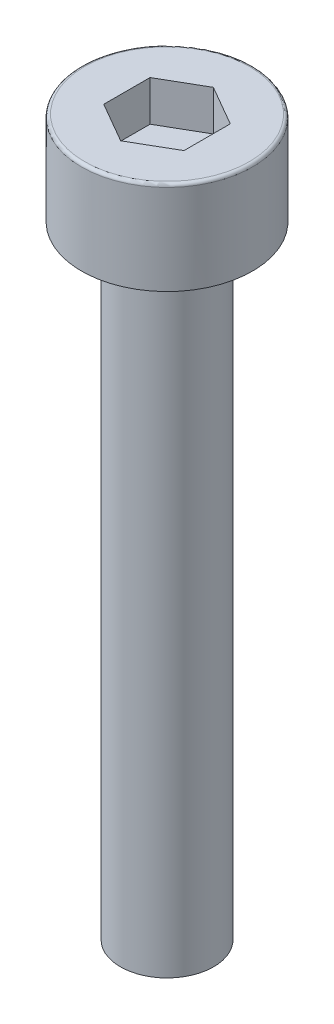
ISO-10303-21;
HEADER;
FILE_DESCRIPTION(('STEP AP214'),'2;1');
FILE_NAME('part.step','',(''),(''),'','','');
FILE_SCHEMA(('AUTOMOTIVE_DESIGN { 1 0 10303 214 1 1 1 1 }'));
ENDSEC;
DATA;
#1=APPLICATION_CONTEXT('core data for automotive mechanical design processes');
#2=APPLICATION_PROTOCOL_DEFINITION('international standard','automotive_design',2000,#1);
#3=PRODUCT_CONTEXT('',#1,'mechanical');
#4=PRODUCT('Part','Part','',(#3));
#5=PRODUCT_RELATED_PRODUCT_CATEGORY('part','',(#4));
#6=PRODUCT_DEFINITION_FORMATION('','',#4);
#7=PRODUCT_DEFINITION_CONTEXT('part definition',#1,'design');
#8=PRODUCT_DEFINITION('design','',#6,#7);
#9=PRODUCT_DEFINITION_SHAPE('','',#8);
#10=(LENGTH_UNIT() NAMED_UNIT(*) SI_UNIT(.MILLI.,.METRE.));
#11=(NAMED_UNIT(*) PLANE_ANGLE_UNIT() SI_UNIT($,.RADIAN.));
#12=(NAMED_UNIT(*) SI_UNIT($,.STERADIAN.) SOLID_ANGLE_UNIT());
#13=UNCERTAINTY_MEASURE_WITH_UNIT(LENGTH_MEASURE(1.E-05),#10,'distance_accuracy_value','');
#14=(GEOMETRIC_REPRESENTATION_CONTEXT(3) GLOBAL_UNCERTAINTY_ASSIGNED_CONTEXT((#13)) GLOBAL_UNIT_ASSIGNED_CONTEXT((#10,
#11,#12)) REPRESENTATION_CONTEXT('',''));
#15=CARTESIAN_POINT('',(0.,0.,0.));
#16=DIRECTION('',(0.,0.,1.));
#17=DIRECTION('',(1.,0.,0.));
#18=AXIS2_PLACEMENT_3D('',#15,#16,#17);
#19=CARTESIAN_POINT('',(1.5,0.,0.));
#20=DIRECTION('',(0.,-1.,0.));
#21=DIRECTION('',(0.,0.,-1.));
#22=AXIS2_PLACEMENT_3D('',#19,#20,#21);
#23=PLANE('',#22);
#24=CARTESIAN_POINT('',(0.,0.,0.));
#25=DIRECTION('',(0.,-1.,0.));
#26=DIRECTION('',(0.,0.,-1.));
#27=AXIS2_PLACEMENT_3D('',#24,#25,#26);
#28=CIRCLE('',#27,1.5);
#29=CARTESIAN_POINT('',(0.,0.,-1.5));
#30=VERTEX_POINT('',#29);
#31=EDGE_CURVE('E135',#30,#30,#28,.T.);
#32=ORIENTED_EDGE('',*,*,#31,.T.);
#33=EDGE_LOOP('',(#32));
#34=FACE_BOUND('',#33,.T.);
#35=ADVANCED_FACE('F33',(#34),#23,.T.);
#36=CARTESIAN_POINT('',(0.,23.,0.));
#37=DIRECTION('',(0.,1.,0.));
#38=DIRECTION('',(0.,0.,1.));
#39=AXIS2_PLACEMENT_3D('',#36,#37,#38);
#40=PLANE('',#39);
#41=CARTESIAN_POINT('',(0.,23.,0.));
#42=DIRECTION('',(0.,1.,0.));
#43=DIRECTION('',(0.,0.,1.));
#44=AXIS2_PLACEMENT_3D('',#41,#42,#43);
#45=CIRCLE('',#44,2.65);
#46=CARTESIAN_POINT('',(0.,23.,2.65));
#47=VERTEX_POINT('',#46);
#48=EDGE_CURVE('E11',#47,#47,#45,.T.);
#49=ORIENTED_EDGE('',*,*,#48,.T.);
#50=EDGE_LOOP('',(#49));
#51=FACE_BOUND('',#50,.T.);
#52=DIRECTION('',(-0.866025403784439,0.,-0.5));
#53=VECTOR('',#52,1.);
#54=CARTESIAN_POINT('',(1.29,23.,-0.744781847254618));
#55=LINE('',#54,#53);
#56=CARTESIAN_POINT('',(1.29,23.,-0.744781847254618));
#57=VERTEX_POINT('',#56);
#58=CARTESIAN_POINT('',(0.,23.,-1.48956369450923));
#59=VERTEX_POINT('',#58);
#60=EDGE_CURVE('E48',#57,#59,#55,.T.);
#61=ORIENTED_EDGE('',*,*,#60,.F.);
#62=DIRECTION('',(0.,0.,-1.));
#63=VECTOR('',#62,1.);
#64=CARTESIAN_POINT('',(1.29,23.,0.744781847254617));
#65=LINE('',#64,#63);
#66=CARTESIAN_POINT('',(1.29,23.,0.744781847254617));
#67=VERTEX_POINT('',#66);
#68=EDGE_CURVE('E131',#67,#57,#65,.T.);
#69=ORIENTED_EDGE('',*,*,#68,.F.);
#70=DIRECTION('',(0.866025403784439,0.,-0.5));
#71=VECTOR('',#70,1.);
#72=CARTESIAN_POINT('',(0.,23.,1.48956369450923));
#73=LINE('',#72,#71);
#74=CARTESIAN_POINT('',(0.,23.,1.48956369450923));
#75=VERTEX_POINT('',#74);
#76=EDGE_CURVE('E129',#75,#67,#73,.T.);
#77=ORIENTED_EDGE('',*,*,#76,.F.);
#78=DIRECTION('',(0.866025403784439,0.,0.5));
#79=VECTOR('',#78,1.);
#80=CARTESIAN_POINT('',(-1.29,23.,0.744781847254618));
#81=LINE('',#80,#79);
#82=CARTESIAN_POINT('',(-1.29,23.,0.744781847254618));
#83=VERTEX_POINT('',#82);
#84=EDGE_CURVE('E96',#83,#75,#81,.T.);
#85=ORIENTED_EDGE('',*,*,#84,.F.);
#86=DIRECTION('',(0.,0.,1.));
#87=VECTOR('',#86,1.);
#88=CARTESIAN_POINT('',(-1.29,23.,-0.744781847254617));
#89=LINE('',#88,#87);
#90=CARTESIAN_POINT('',(-1.29,23.,-0.744781847254617));
#91=VERTEX_POINT('',#90);
#92=EDGE_CURVE('E125',#91,#83,#89,.T.);
#93=ORIENTED_EDGE('',*,*,#92,.F.);
#94=DIRECTION('',(-0.866025403784439,0.,0.5));
#95=VECTOR('',#94,1.);
#96=CARTESIAN_POINT('',(0.,23.,-1.48956369450923));
#97=LINE('',#96,#95);
#98=EDGE_CURVE('E122',#59,#91,#97,.T.);
#99=ORIENTED_EDGE('',*,*,#98,.F.);
#100=EDGE_LOOP('',(#61,#69,#77,#85,#93,#99));
#101=FACE_BOUND('',#100,.T.);
#102=ADVANCED_FACE('F163',(#51,#101),#40,.T.);
#103=CARTESIAN_POINT('',(0.,0.,0.));
#104=DIRECTION('',(0.,-1.,0.));
#105=DIRECTION('',(0.,0.,-1.));
#106=AXIS2_PLACEMENT_3D('',#103,#104,#105);
#107=CYLINDRICAL_SURFACE('',#106,2.75);
#108=CARTESIAN_POINT('',(0.,22.9,0.));
#109=DIRECTION('',(0.,1.,0.));
#110=DIRECTION('',(0.,0.,1.));
#111=AXIS2_PLACEMENT_3D('',#108,#109,#110);
#112=CIRCLE('',#111,2.75);
#113=CARTESIAN_POINT('',(0.,22.9,2.75));
#114=VERTEX_POINT('',#113);
#115=EDGE_CURVE('E41',#114,#114,#112,.F.);
#116=ORIENTED_EDGE('',*,*,#115,.T.);
#117=EDGE_LOOP('',(#116));
#118=FACE_BOUND('',#117,.T.);
#119=CARTESIAN_POINT('',(0.,20.,0.));
#120=DIRECTION('',(0.,-1.,0.));
#121=DIRECTION('',(0.,0.,-1.));
#122=AXIS2_PLACEMENT_3D('',#119,#120,#121);
#123=CIRCLE('',#122,2.75);
#124=CARTESIAN_POINT('',(0.,20.,-2.75));
#125=VERTEX_POINT('',#124);
#126=EDGE_CURVE('E146',#125,#125,#123,.T.);
#127=ORIENTED_EDGE('',*,*,#126,.F.);
#128=EDGE_LOOP('',(#127));
#129=FACE_BOUND('',#128,.T.);
#130=ADVANCED_FACE('F151',(#118,#129),#107,.T.);
#131=CARTESIAN_POINT('',(2.75,20.,0.));
#132=DIRECTION('',(0.,-1.,0.));
#133=DIRECTION('',(0.,0.,-1.));
#134=AXIS2_PLACEMENT_3D('',#131,#132,#133);
#135=PLANE('',#134);
#136=ORIENTED_EDGE('',*,*,#126,.T.);
#137=EDGE_LOOP('',(#136));
#138=FACE_BOUND('',#137,.T.);
#139=CARTESIAN_POINT('',(0.,20.,0.));
#140=DIRECTION('',(0.,-1.,0.));
#141=DIRECTION('',(0.,0.,-1.));
#142=AXIS2_PLACEMENT_3D('',#139,#140,#141);
#143=CIRCLE('',#142,1.5);
#144=CARTESIAN_POINT('',(0.,20.,-1.5));
#145=VERTEX_POINT('',#144);
#146=EDGE_CURVE('E143',#145,#145,#143,.T.);
#147=ORIENTED_EDGE('',*,*,#146,.F.);
#148=EDGE_LOOP('',(#147));
#149=FACE_BOUND('',#148,.T.);
#150=ADVANCED_FACE('F173',(#138,#149),#135,.T.);
#151=CARTESIAN_POINT('',(0.,0.,0.));
#152=DIRECTION('',(0.,-1.,0.));
#153=DIRECTION('',(0.,0.,-1.));
#154=AXIS2_PLACEMENT_3D('',#151,#152,#153);
#155=CYLINDRICAL_SURFACE('',#154,1.5);
#156=ORIENTED_EDGE('',*,*,#146,.T.);
#157=EDGE_LOOP('',(#156));
#158=FACE_BOUND('',#157,.T.);
#159=ORIENTED_EDGE('',*,*,#31,.F.);
#160=EDGE_LOOP('',(#159));
#161=FACE_BOUND('',#160,.T.);
#162=ADVANCED_FACE('F176',(#158,#161),#155,.T.);
#163=CARTESIAN_POINT('',(1.29,21.7,-0.744781847254618));
#164=DIRECTION('',(0.5,0.,-0.866025403784439));
#165=DIRECTION('',(-0.866025403784439,0.,-0.5));
#166=AXIS2_PLACEMENT_3D('',#163,#164,#165);
#167=PLANE('',#166);
#168=ORIENTED_EDGE('',*,*,#60,.T.);
#169=DIRECTION('',(0.,1.,0.));
#170=VECTOR('',#169,1.);
#171=CARTESIAN_POINT('',(0.,21.7,-1.48956369450923));
#172=LINE('',#171,#170);
#173=CARTESIAN_POINT('',(0.,21.7,-1.48956369450923));
#174=VERTEX_POINT('',#173);
#175=EDGE_CURVE('E78',#174,#59,#172,.T.);
#176=ORIENTED_EDGE('',*,*,#175,.F.);
#177=DIRECTION('',(-0.866025403784439,0.,-0.5));
#178=VECTOR('',#177,1.);
#179=CARTESIAN_POINT('',(1.29,21.7,-0.744781847254618));
#180=LINE('',#179,#178);
#181=CARTESIAN_POINT('',(1.29,21.7,-0.744781847254618));
#182=VERTEX_POINT('',#181);
#183=EDGE_CURVE('E133',#182,#174,#180,.T.);
#184=ORIENTED_EDGE('',*,*,#183,.F.);
#185=DIRECTION('',(0.,1.,0.));
#186=VECTOR('',#185,1.);
#187=CARTESIAN_POINT('',(1.29,21.7,-0.744781847254618));
#188=LINE('',#187,#186);
#189=EDGE_CURVE('E56',#182,#57,#188,.T.);
#190=ORIENTED_EDGE('',*,*,#189,.T.);
#191=EDGE_LOOP('',(#168,#176,#184,#190));
#192=FACE_BOUND('',#191,.T.);
#193=ADVANCED_FACE('F180',(#192),#167,.F.);
#194=CARTESIAN_POINT('',(1.29,21.7,0.744781847254617));
#195=DIRECTION('',(1.,0.,0.));
#196=DIRECTION('',(0.,0.,-1.));
#197=AXIS2_PLACEMENT_3D('',#194,#195,#196);
#198=PLANE('',#197);
#199=ORIENTED_EDGE('',*,*,#68,.T.);
#200=ORIENTED_EDGE('',*,*,#189,.F.);
#201=DIRECTION('',(0.,0.,-1.));
#202=VECTOR('',#201,1.);
#203=CARTESIAN_POINT('',(1.29,21.7,0.744781847254617));
#204=LINE('',#203,#202);
#205=CARTESIAN_POINT('',(1.29,21.7,0.744781847254617));
#206=VERTEX_POINT('',#205);
#207=EDGE_CURVE('E108',#206,#182,#204,.T.);
#208=ORIENTED_EDGE('',*,*,#207,.F.);
#209=DIRECTION('',(0.,1.,0.));
#210=VECTOR('',#209,1.);
#211=CARTESIAN_POINT('',(1.29,21.7,0.744781847254617));
#212=LINE('',#211,#210);
#213=EDGE_CURVE('E100',#206,#67,#212,.T.);
#214=ORIENTED_EDGE('',*,*,#213,.T.);
#215=EDGE_LOOP('',(#199,#200,#208,#214));
#216=FACE_BOUND('',#215,.T.);
#217=ADVANCED_FACE('F184',(#216),#198,.F.);
#218=CARTESIAN_POINT('',(0.,21.7,1.48956369450923));
#219=DIRECTION('',(0.5,0.,0.866025403784439));
#220=DIRECTION('',(0.866025403784439,0.,-0.5));
#221=AXIS2_PLACEMENT_3D('',#218,#219,#220);
#222=PLANE('',#221);
#223=ORIENTED_EDGE('',*,*,#76,.T.);
#224=ORIENTED_EDGE('',*,*,#213,.F.);
#225=DIRECTION('',(0.866025403784439,0.,-0.5));
#226=VECTOR('',#225,1.);
#227=CARTESIAN_POINT('',(0.,21.7,1.48956369450923));
#228=LINE('',#227,#226);
#229=CARTESIAN_POINT('',(0.,21.7,1.48956369450923));
#230=VERTEX_POINT('',#229);
#231=EDGE_CURVE('E104',#230,#206,#228,.T.);
#232=ORIENTED_EDGE('',*,*,#231,.F.);
#233=DIRECTION('',(0.,1.,0.));
#234=VECTOR('',#233,1.);
#235=CARTESIAN_POINT('',(0.,21.7,1.48956369450923));
#236=LINE('',#235,#234);
#237=EDGE_CURVE('E89',#230,#75,#236,.T.);
#238=ORIENTED_EDGE('',*,*,#237,.T.);
#239=EDGE_LOOP('',(#223,#224,#232,#238));
#240=FACE_BOUND('',#239,.T.);
#241=ADVANCED_FACE('F105',(#240),#222,.F.);
#242=CARTESIAN_POINT('',(-1.29,21.7,0.744781847254618));
#243=DIRECTION('',(-0.5,0.,0.866025403784439));
#244=DIRECTION('',(0.866025403784439,0.,0.5));
#245=AXIS2_PLACEMENT_3D('',#242,#243,#244);
#246=PLANE('',#245);
#247=ORIENTED_EDGE('',*,*,#84,.T.);
#248=ORIENTED_EDGE('',*,*,#237,.F.);
#249=DIRECTION('',(0.866025403784439,0.,0.5));
#250=VECTOR('',#249,1.);
#251=CARTESIAN_POINT('',(-1.29,21.7,0.744781847254618));
#252=LINE('',#251,#250);
#253=CARTESIAN_POINT('',(-1.29,21.7,0.744781847254618));
#254=VERTEX_POINT('',#253);
#255=EDGE_CURVE('E93',#254,#230,#252,.T.);
#256=ORIENTED_EDGE('',*,*,#255,.F.);
#257=DIRECTION('',(0.,1.,0.));
#258=VECTOR('',#257,1.);
#259=CARTESIAN_POINT('',(-1.29,21.7,0.744781847254618));
#260=LINE('',#259,#258);
#261=EDGE_CURVE('E101',#254,#83,#260,.T.);
#262=ORIENTED_EDGE('',*,*,#261,.T.);
#263=EDGE_LOOP('',(#247,#248,#256,#262));
#264=FACE_BOUND('',#263,.T.);
#265=ADVANCED_FACE('F91',(#264),#246,.F.);
#266=CARTESIAN_POINT('',(-1.29,21.7,-0.744781847254617));
#267=DIRECTION('',(-1.,0.,0.));
#268=DIRECTION('',(0.,0.,1.));
#269=AXIS2_PLACEMENT_3D('',#266,#267,#268);
#270=PLANE('',#269);
#271=ORIENTED_EDGE('',*,*,#92,.T.);
#272=ORIENTED_EDGE('',*,*,#261,.F.);
#273=DIRECTION('',(0.,0.,1.));
#274=VECTOR('',#273,1.);
#275=CARTESIAN_POINT('',(-1.29,21.7,-0.744781847254617));
#276=LINE('',#275,#274);
#277=CARTESIAN_POINT('',(-1.29,21.7,-0.744781847254617));
#278=VERTEX_POINT('',#277);
#279=EDGE_CURVE('E114',#278,#254,#276,.T.);
#280=ORIENTED_EDGE('',*,*,#279,.F.);
#281=DIRECTION('',(0.,1.,0.));
#282=VECTOR('',#281,1.);
#283=CARTESIAN_POINT('',(-1.29,21.7,-0.744781847254617));
#284=LINE('',#283,#282);
#285=EDGE_CURVE('E138',#278,#91,#284,.T.);
#286=ORIENTED_EDGE('',*,*,#285,.T.);
#287=EDGE_LOOP('',(#271,#272,#280,#286));
#288=FACE_BOUND('',#287,.T.);
#289=ADVANCED_FACE('F187',(#288),#270,.F.);
#290=CARTESIAN_POINT('',(0.,21.7,-1.48956369450923));
#291=DIRECTION('',(-0.5,0.,-0.866025403784439));
#292=DIRECTION('',(-0.866025403784439,0.,0.5));
#293=AXIS2_PLACEMENT_3D('',#290,#291,#292);
#294=PLANE('',#293);
#295=ORIENTED_EDGE('',*,*,#98,.T.);
#296=ORIENTED_EDGE('',*,*,#285,.F.);
#297=DIRECTION('',(-0.866025403784439,0.,0.5));
#298=VECTOR('',#297,1.);
#299=CARTESIAN_POINT('',(0.,21.7,-1.48956369450923));
#300=LINE('',#299,#298);
#301=EDGE_CURVE('E116',#174,#278,#300,.T.);
#302=ORIENTED_EDGE('',*,*,#301,.F.);
#303=ORIENTED_EDGE('',*,*,#175,.T.);
#304=EDGE_LOOP('',(#295,#296,#302,#303));
#305=FACE_BOUND('',#304,.T.);
#306=ADVANCED_FACE('F159',(#305),#294,.F.);
#307=CARTESIAN_POINT('',(0.,21.7,0.));
#308=DIRECTION('',(0.,1.,0.));
#309=DIRECTION('',(0.,0.,1.));
#310=AXIS2_PLACEMENT_3D('',#307,#308,#309);
#311=PLANE('',#310);
#312=ORIENTED_EDGE('',*,*,#183,.T.);
#313=ORIENTED_EDGE('',*,*,#301,.T.);
#314=ORIENTED_EDGE('',*,*,#279,.T.);
#315=ORIENTED_EDGE('',*,*,#255,.T.);
#316=ORIENTED_EDGE('',*,*,#231,.T.);
#317=ORIENTED_EDGE('',*,*,#207,.T.);
#318=EDGE_LOOP('',(#312,#313,#314,#315,#316,#317));
#319=FACE_BOUND('',#318,.T.);
#320=ADVANCED_FACE('F111',(#319),#311,.T.);
#321=CARTESIAN_POINT('',(0.,22.9,0.));
#322=DIRECTION('',(0.,1.,0.));
#323=DIRECTION('',(0.,0.,1.));
#324=AXIS2_PLACEMENT_3D('',#321,#322,#323);
#325=TOROIDAL_SURFACE('',#324,2.65,0.1);
#326=ORIENTED_EDGE('',*,*,#48,.F.);
#327=EDGE_LOOP('',(#326));
#328=FACE_BOUND('',#327,.T.);
#329=ORIENTED_EDGE('',*,*,#115,.F.);
#330=EDGE_LOOP('',(#329));
#331=FACE_BOUND('',#330,.T.);
#332=ADVANCED_FACE('F35',(#328,#331),#325,.T.);
#333=CLOSED_SHELL('',(#35,#102,#130,#150,#162,#193,#217,#241,#265,#289,#306,#320,#332));
#334=MANIFOLD_SOLID_BREP('B2',#333);
#335=ADVANCED_BREP_SHAPE_REPRESENTATION('',(#18,#334),#14);
#336=SHAPE_DEFINITION_REPRESENTATION(#9,#335);
ENDSEC;
END-ISO-10303-21;
